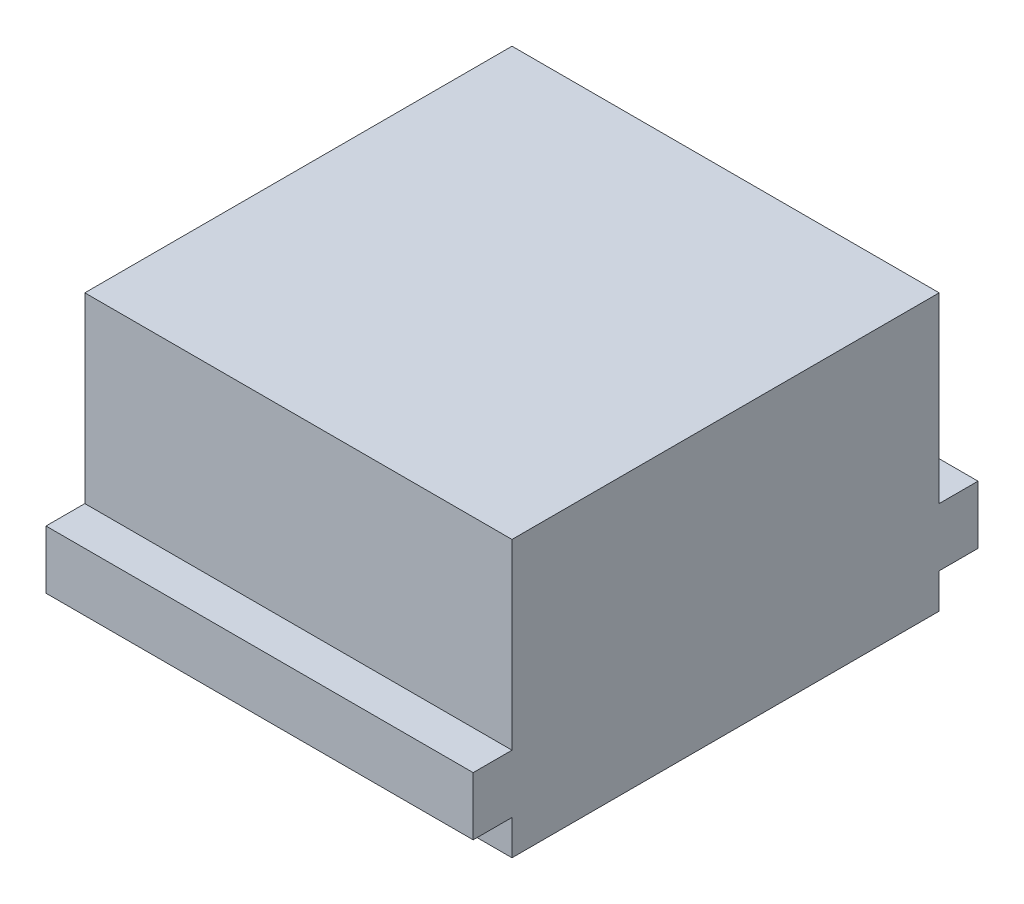
ISO-10303-21;
HEADER;
FILE_DESCRIPTION(('STEP AP214'),'2;1');
FILE_NAME('part.step','',(''),(''),'','','');
FILE_SCHEMA(('AUTOMOTIVE_DESIGN { 1 0 10303 214 1 1 1 1 }'));
ENDSEC;
DATA;
#1=APPLICATION_CONTEXT('core data for automotive mechanical design processes');
#2=APPLICATION_PROTOCOL_DEFINITION('international standard','automotive_design',2000,#1);
#3=PRODUCT_CONTEXT('',#1,'mechanical');
#4=PRODUCT('Part','Part','',(#3));
#5=PRODUCT_RELATED_PRODUCT_CATEGORY('part','',(#4));
#6=PRODUCT_DEFINITION_FORMATION('','',#4);
#7=PRODUCT_DEFINITION_CONTEXT('part definition',#1,'design');
#8=PRODUCT_DEFINITION('design','',#6,#7);
#9=PRODUCT_DEFINITION_SHAPE('','',#8);
#10=(LENGTH_UNIT() NAMED_UNIT(*) SI_UNIT(.MILLI.,.METRE.));
#11=(NAMED_UNIT(*) PLANE_ANGLE_UNIT() SI_UNIT($,.RADIAN.));
#12=(NAMED_UNIT(*) SI_UNIT($,.STERADIAN.) SOLID_ANGLE_UNIT());
#13=UNCERTAINTY_MEASURE_WITH_UNIT(LENGTH_MEASURE(1.E-05),#10,'distance_accuracy_value','');
#14=(GEOMETRIC_REPRESENTATION_CONTEXT(3) GLOBAL_UNCERTAINTY_ASSIGNED_CONTEXT((#13)) GLOBAL_UNIT_ASSIGNED_CONTEXT((#10,
#11,#12)) REPRESENTATION_CONTEXT('',''));
#15=CARTESIAN_POINT('',(0.,0.,0.));
#16=DIRECTION('',(0.,0.,1.));
#17=DIRECTION('',(1.,0.,0.));
#18=AXIS2_PLACEMENT_3D('',#15,#16,#17);
#19=CARTESIAN_POINT('',(0.,71.,-110.));
#20=DIRECTION('',(0.,0.,1.));
#21=DIRECTION('',(1.,0.,0.));
#22=AXIS2_PLACEMENT_3D('',#19,#20,#21);
#23=PLANE('',#22);
#24=DIRECTION('',(-1.,0.,0.));
#25=VECTOR('',#24,1.);
#26=CARTESIAN_POINT('',(0.,9.,-110.));
#27=LINE('',#26,#25);
#28=CARTESIAN_POINT('',(110.,9.,-110.));
#29=VERTEX_POINT('',#28);
#30=CARTESIAN_POINT('',(0.,9.,-110.));
#31=VERTEX_POINT('',#30);
#32=EDGE_CURVE('E56',#29,#31,#27,.T.);
#33=ORIENTED_EDGE('',*,*,#32,.F.);
#34=DIRECTION('',(0.,-1.,0.));
#35=VECTOR('',#34,1.);
#36=CARTESIAN_POINT('',(110.,71.,-110.));
#37=LINE('',#36,#35);
#38=CARTESIAN_POINT('',(110.,0.,-110.));
#39=VERTEX_POINT('',#38);
#40=EDGE_CURVE('E152',#29,#39,#37,.T.);
#41=ORIENTED_EDGE('',*,*,#40,.T.);
#42=DIRECTION('',(-1.,0.,0.));
#43=VECTOR('',#42,1.);
#44=CARTESIAN_POINT('',(0.,0.,-110.));
#45=LINE('',#44,#43);
#46=CARTESIAN_POINT('',(0.,0.,-110.));
#47=VERTEX_POINT('',#46);
#48=EDGE_CURVE('E190',#39,#47,#45,.T.);
#49=ORIENTED_EDGE('',*,*,#48,.T.);
#50=DIRECTION('',(0.,-1.,0.));
#51=VECTOR('',#50,1.);
#52=CARTESIAN_POINT('',(0.,71.,-110.));
#53=LINE('',#52,#51);
#54=EDGE_CURVE('E196',#31,#47,#53,.T.);
#55=ORIENTED_EDGE('',*,*,#54,.F.);
#56=EDGE_LOOP('',(#33,#41,#49,#55));
#57=FACE_BOUND('',#56,.T.);
#58=ADVANCED_FACE('F41',(#57),#23,.F.);
#59=CARTESIAN_POINT('',(0.,71.,0.));
#60=DIRECTION('',(0.,0.,-1.));
#61=DIRECTION('',(-1.,0.,0.));
#62=AXIS2_PLACEMENT_3D('',#59,#60,#61);
#63=PLANE('',#62);
#64=DIRECTION('',(-1.,0.,0.));
#65=VECTOR('',#64,1.);
#66=CARTESIAN_POINT('',(0.,24.,0.));
#67=LINE('',#66,#65);
#68=CARTESIAN_POINT('',(110.,24.,0.));
#69=VERTEX_POINT('',#68);
#70=CARTESIAN_POINT('',(0.,24.,0.));
#71=VERTEX_POINT('',#70);
#72=EDGE_CURVE('E156',#69,#71,#67,.T.);
#73=ORIENTED_EDGE('',*,*,#72,.F.);
#74=DIRECTION('',(0.,-1.,0.));
#75=VECTOR('',#74,1.);
#76=CARTESIAN_POINT('',(110.,71.,0.));
#77=LINE('',#76,#75);
#78=CARTESIAN_POINT('',(110.,71.,0.));
#79=VERTEX_POINT('',#78);
#80=EDGE_CURVE('E210',#79,#69,#77,.T.);
#81=ORIENTED_EDGE('',*,*,#80,.F.);
#82=DIRECTION('',(1.,0.,0.));
#83=VECTOR('',#82,1.);
#84=CARTESIAN_POINT('',(0.,71.,0.));
#85=LINE('',#84,#83);
#86=CARTESIAN_POINT('',(0.,71.,0.));
#87=VERTEX_POINT('',#86);
#88=EDGE_CURVE('E189',#87,#79,#85,.T.);
#89=ORIENTED_EDGE('',*,*,#88,.F.);
#90=DIRECTION('',(0.,-1.,0.));
#91=VECTOR('',#90,1.);
#92=CARTESIAN_POINT('',(0.,71.,0.));
#93=LINE('',#92,#91);
#94=EDGE_CURVE('E11',#87,#71,#93,.T.);
#95=ORIENTED_EDGE('',*,*,#94,.T.);
#96=EDGE_LOOP('',(#73,#81,#89,#95));
#97=FACE_BOUND('',#96,.T.);
#98=ADVANCED_FACE('F245',(#97),#63,.F.);
#99=DIRECTION('',(1.,0.,0.));
#100=VECTOR('',#99,1.);
#101=CARTESIAN_POINT('',(0.,8.99999999999999,0.));
#102=LINE('',#101,#100);
#103=CARTESIAN_POINT('',(0.,8.99999999999999,0.));
#104=VERTEX_POINT('',#103);
#105=CARTESIAN_POINT('',(110.,8.99999999999999,0.));
#106=VERTEX_POINT('',#105);
#107=EDGE_CURVE('E153',#104,#106,#102,.T.);
#108=ORIENTED_EDGE('',*,*,#107,.F.);
#109=CARTESIAN_POINT('',(0.,0.,0.));
#110=VERTEX_POINT('',#109);
#111=EDGE_CURVE('E49',#104,#110,#93,.T.);
#112=ORIENTED_EDGE('',*,*,#111,.T.);
#113=DIRECTION('',(1.,0.,0.));
#114=VECTOR('',#113,1.);
#115=CARTESIAN_POINT('',(0.,0.,0.));
#116=LINE('',#115,#114);
#117=CARTESIAN_POINT('',(110.,0.,0.));
#118=VERTEX_POINT('',#117);
#119=EDGE_CURVE('E199',#110,#118,#116,.T.);
#120=ORIENTED_EDGE('',*,*,#119,.T.);
#121=EDGE_CURVE('E209',#106,#118,#77,.T.);
#122=ORIENTED_EDGE('',*,*,#121,.F.);
#123=EDGE_LOOP('',(#108,#112,#120,#122));
#124=FACE_BOUND('',#123,.T.);
#125=ADVANCED_FACE('F221',(#124),#63,.F.);
#126=CARTESIAN_POINT('',(0.,71.,0.));
#127=DIRECTION('',(1.,0.,0.));
#128=DIRECTION('',(0.,0.,-1.));
#129=AXIS2_PLACEMENT_3D('',#126,#127,#128);
#130=PLANE('',#129);
#131=DIRECTION('',(0.,0.,1.));
#132=VECTOR('',#131,1.);
#133=CARTESIAN_POINT('',(0.,0.,0.));
#134=LINE('',#133,#132);
#135=EDGE_CURVE('E185',#47,#110,#134,.T.);
#136=ORIENTED_EDGE('',*,*,#135,.T.);
#137=ORIENTED_EDGE('',*,*,#111,.F.);
#138=DIRECTION('',(0.,0.,-1.));
#139=VECTOR('',#138,1.);
#140=CARTESIAN_POINT('',(0.,8.99999999999999,10.));
#141=LINE('',#140,#139);
#142=CARTESIAN_POINT('',(0.,8.99999999999999,10.));
#143=VERTEX_POINT('',#142);
#144=EDGE_CURVE('E182',#143,#104,#141,.T.);
#145=ORIENTED_EDGE('',*,*,#144,.F.);
#146=DIRECTION('',(0.,-1.,0.));
#147=VECTOR('',#146,1.);
#148=CARTESIAN_POINT('',(0.,0.,10.));
#149=LINE('',#148,#147);
#150=CARTESIAN_POINT('',(0.,24.,10.));
#151=VERTEX_POINT('',#150);
#152=EDGE_CURVE('E162',#151,#143,#149,.T.);
#153=ORIENTED_EDGE('',*,*,#152,.F.);
#154=DIRECTION('',(0.,0.,-1.));
#155=VECTOR('',#154,1.);
#156=CARTESIAN_POINT('',(0.,24.,10.));
#157=LINE('',#156,#155);
#158=EDGE_CURVE('E170',#151,#71,#157,.T.);
#159=ORIENTED_EDGE('',*,*,#158,.T.);
#160=ORIENTED_EDGE('',*,*,#94,.F.);
#161=DIRECTION('',(0.,0.,1.));
#162=VECTOR('',#161,1.);
#163=CARTESIAN_POINT('',(0.,71.,0.));
#164=LINE('',#163,#162);
#165=CARTESIAN_POINT('',(0.,71.,-110.));
#166=VERTEX_POINT('',#165);
#167=EDGE_CURVE('E186',#166,#87,#164,.T.);
#168=ORIENTED_EDGE('',*,*,#167,.F.);
#169=CARTESIAN_POINT('',(0.,24.,-110.));
#170=VERTEX_POINT('',#169);
#171=EDGE_CURVE('E206',#166,#170,#53,.T.);
#172=ORIENTED_EDGE('',*,*,#171,.T.);
#173=DIRECTION('',(0.,0.,1.));
#174=VECTOR('',#173,1.);
#175=CARTESIAN_POINT('',(0.,24.,-120.));
#176=LINE('',#175,#174);
#177=CARTESIAN_POINT('',(0.,24.,-120.));
#178=VERTEX_POINT('',#177);
#179=EDGE_CURVE('E158',#178,#170,#176,.T.);
#180=ORIENTED_EDGE('',*,*,#179,.F.);
#181=DIRECTION('',(0.,1.,0.));
#182=VECTOR('',#181,1.);
#183=CARTESIAN_POINT('',(0.,0.,-120.));
#184=LINE('',#183,#182);
#185=CARTESIAN_POINT('',(0.,9.,-120.));
#186=VERTEX_POINT('',#185);
#187=EDGE_CURVE('E139',#186,#178,#184,.T.);
#188=ORIENTED_EDGE('',*,*,#187,.F.);
#189=DIRECTION('',(0.,0.,1.));
#190=VECTOR('',#189,1.);
#191=CARTESIAN_POINT('',(0.,9.,-120.));
#192=LINE('',#191,#190);
#193=EDGE_CURVE('E136',#186,#31,#192,.T.);
#194=ORIENTED_EDGE('',*,*,#193,.T.);
#195=ORIENTED_EDGE('',*,*,#54,.T.);
#196=EDGE_LOOP('',(#136,#137,#145,#153,#159,#160,#168,#172,#180,#188,#194,#195));
#197=FACE_BOUND('',#196,.T.);
#198=ADVANCED_FACE('F43',(#197),#130,.F.);
#199=CARTESIAN_POINT('',(110.,71.,0.));
#200=DIRECTION('',(-1.,0.,0.));
#201=DIRECTION('',(0.,0.,1.));
#202=AXIS2_PLACEMENT_3D('',#199,#200,#201);
#203=PLANE('',#202);
#204=DIRECTION('',(0.,0.,-1.));
#205=VECTOR('',#204,1.);
#206=CARTESIAN_POINT('',(110.,0.,0.));
#207=LINE('',#206,#205);
#208=EDGE_CURVE('E202',#118,#39,#207,.T.);
#209=ORIENTED_EDGE('',*,*,#208,.T.);
#210=ORIENTED_EDGE('',*,*,#40,.F.);
#211=DIRECTION('',(0.,0.,1.));
#212=VECTOR('',#211,1.);
#213=CARTESIAN_POINT('',(110.,9.,-120.));
#214=LINE('',#213,#212);
#215=CARTESIAN_POINT('',(110.,9.,-120.));
#216=VERTEX_POINT('',#215);
#217=EDGE_CURVE('E134',#216,#29,#214,.T.);
#218=ORIENTED_EDGE('',*,*,#217,.F.);
#219=DIRECTION('',(0.,-1.,0.));
#220=VECTOR('',#219,1.);
#221=CARTESIAN_POINT('',(110.,0.,-120.));
#222=LINE('',#221,#220);
#223=CARTESIAN_POINT('',(110.,24.,-120.));
#224=VERTEX_POINT('',#223);
#225=EDGE_CURVE('E140',#224,#216,#222,.T.);
#226=ORIENTED_EDGE('',*,*,#225,.F.);
#227=DIRECTION('',(0.,0.,1.));
#228=VECTOR('',#227,1.);
#229=CARTESIAN_POINT('',(110.,24.,-120.));
#230=LINE('',#229,#228);
#231=CARTESIAN_POINT('',(110.,24.,-110.));
#232=VERTEX_POINT('',#231);
#233=EDGE_CURVE('E231',#224,#232,#230,.T.);
#234=ORIENTED_EDGE('',*,*,#233,.T.);
#235=CARTESIAN_POINT('',(110.,71.,-110.));
#236=VERTEX_POINT('',#235);
#237=EDGE_CURVE('E64',#236,#232,#37,.T.);
#238=ORIENTED_EDGE('',*,*,#237,.F.);
#239=DIRECTION('',(0.,0.,-1.));
#240=VECTOR('',#239,1.);
#241=CARTESIAN_POINT('',(110.,71.,0.));
#242=LINE('',#241,#240);
#243=EDGE_CURVE('E192',#79,#236,#242,.T.);
#244=ORIENTED_EDGE('',*,*,#243,.F.);
#245=ORIENTED_EDGE('',*,*,#80,.T.);
#246=DIRECTION('',(0.,0.,-1.));
#247=VECTOR('',#246,1.);
#248=CARTESIAN_POINT('',(110.,24.,10.));
#249=LINE('',#248,#247);
#250=CARTESIAN_POINT('',(110.,24.,10.));
#251=VERTEX_POINT('',#250);
#252=EDGE_CURVE('E176',#251,#69,#249,.T.);
#253=ORIENTED_EDGE('',*,*,#252,.F.);
#254=DIRECTION('',(0.,1.,0.));
#255=VECTOR('',#254,1.);
#256=CARTESIAN_POINT('',(110.,0.,10.));
#257=LINE('',#256,#255);
#258=CARTESIAN_POINT('',(110.,8.99999999999999,10.));
#259=VERTEX_POINT('',#258);
#260=EDGE_CURVE('E167',#259,#251,#257,.T.);
#261=ORIENTED_EDGE('',*,*,#260,.F.);
#262=DIRECTION('',(0.,0.,-1.));
#263=VECTOR('',#262,1.);
#264=CARTESIAN_POINT('',(110.,8.99999999999999,10.));
#265=LINE('',#264,#263);
#266=EDGE_CURVE('E179',#259,#106,#265,.T.);
#267=ORIENTED_EDGE('',*,*,#266,.T.);
#268=ORIENTED_EDGE('',*,*,#121,.T.);
#269=EDGE_LOOP('',(#209,#210,#218,#226,#234,#238,#244,#245,#253,#261,#267,#268));
#270=FACE_BOUND('',#269,.T.);
#271=ADVANCED_FACE('F151',(#270),#203,.F.);
#272=ORIENTED_EDGE('',*,*,#237,.T.);
#273=DIRECTION('',(-1.,0.,0.));
#274=VECTOR('',#273,1.);
#275=CARTESIAN_POINT('',(0.,24.,-110.));
#276=LINE('',#275,#274);
#277=EDGE_CURVE('E148',#232,#170,#276,.T.);
#278=ORIENTED_EDGE('',*,*,#277,.T.);
#279=ORIENTED_EDGE('',*,*,#171,.F.);
#280=DIRECTION('',(-1.,0.,0.));
#281=VECTOR('',#280,1.);
#282=CARTESIAN_POINT('',(0.,71.,-110.));
#283=LINE('',#282,#281);
#284=EDGE_CURVE('E194',#236,#166,#283,.T.);
#285=ORIENTED_EDGE('',*,*,#284,.F.);
#286=EDGE_LOOP('',(#272,#278,#279,#285));
#287=FACE_BOUND('',#286,.T.);
#288=ADVANCED_FACE('F239',(#287),#23,.F.);
#289=CARTESIAN_POINT('',(0.,71.,0.));
#290=DIRECTION('',(0.,-1.,0.));
#291=DIRECTION('',(0.,0.,-1.));
#292=AXIS2_PLACEMENT_3D('',#289,#290,#291);
#293=PLANE('',#292);
#294=ORIENTED_EDGE('',*,*,#167,.T.);
#295=ORIENTED_EDGE('',*,*,#88,.T.);
#296=ORIENTED_EDGE('',*,*,#243,.T.);
#297=ORIENTED_EDGE('',*,*,#284,.T.);
#298=EDGE_LOOP('',(#294,#295,#296,#297));
#299=FACE_BOUND('',#298,.T.);
#300=ADVANCED_FACE('F242',(#299),#293,.F.);
#301=CARTESIAN_POINT('',(0.,0.,0.));
#302=DIRECTION('',(0.,-1.,0.));
#303=DIRECTION('',(0.,0.,-1.));
#304=AXIS2_PLACEMENT_3D('',#301,#302,#303);
#305=PLANE('',#304);
#306=ORIENTED_EDGE('',*,*,#135,.F.);
#307=ORIENTED_EDGE('',*,*,#48,.F.);
#308=ORIENTED_EDGE('',*,*,#208,.F.);
#309=ORIENTED_EDGE('',*,*,#119,.F.);
#310=EDGE_LOOP('',(#306,#307,#308,#309));
#311=FACE_BOUND('',#310,.T.);
#312=ADVANCED_FACE('F225',(#311),#305,.T.);
#313=CARTESIAN_POINT('',(0.,8.99999999999999,10.));
#314=DIRECTION('',(0.,1.,0.));
#315=DIRECTION('',(0.,0.,1.));
#316=AXIS2_PLACEMENT_3D('',#313,#314,#315);
#317=PLANE('',#316);
#318=ORIENTED_EDGE('',*,*,#107,.T.);
#319=ORIENTED_EDGE('',*,*,#266,.F.);
#320=DIRECTION('',(1.,0.,0.));
#321=VECTOR('',#320,1.);
#322=CARTESIAN_POINT('',(0.,8.99999999999999,10.));
#323=LINE('',#322,#321);
#324=EDGE_CURVE('E165',#143,#259,#323,.T.);
#325=ORIENTED_EDGE('',*,*,#324,.F.);
#326=ORIENTED_EDGE('',*,*,#144,.T.);
#327=EDGE_LOOP('',(#318,#319,#325,#326));
#328=FACE_BOUND('',#327,.T.);
#329=ADVANCED_FACE('F255',(#328),#317,.F.);
#330=CARTESIAN_POINT('',(0.,24.,10.));
#331=DIRECTION('',(0.,-1.,0.));
#332=DIRECTION('',(1.,0.,0.));
#333=AXIS2_PLACEMENT_3D('',#330,#331,#332);
#334=PLANE('',#333);
#335=ORIENTED_EDGE('',*,*,#72,.T.);
#336=ORIENTED_EDGE('',*,*,#158,.F.);
#337=DIRECTION('',(-1.,0.,0.));
#338=VECTOR('',#337,1.);
#339=CARTESIAN_POINT('',(0.,24.,10.));
#340=LINE('',#339,#338);
#341=EDGE_CURVE('E169',#251,#151,#340,.T.);
#342=ORIENTED_EDGE('',*,*,#341,.F.);
#343=ORIENTED_EDGE('',*,*,#252,.T.);
#344=EDGE_LOOP('',(#335,#336,#342,#343));
#345=FACE_BOUND('',#344,.T.);
#346=ADVANCED_FACE('F248',(#345),#334,.F.);
#347=CARTESIAN_POINT('',(0.,0.,10.));
#348=DIRECTION('',(0.,0.,1.));
#349=DIRECTION('',(1.,0.,0.));
#350=AXIS2_PLACEMENT_3D('',#347,#348,#349);
#351=PLANE('',#350);
#352=ORIENTED_EDGE('',*,*,#152,.T.);
#353=ORIENTED_EDGE('',*,*,#324,.T.);
#354=ORIENTED_EDGE('',*,*,#260,.T.);
#355=ORIENTED_EDGE('',*,*,#341,.T.);
#356=EDGE_LOOP('',(#352,#353,#354,#355));
#357=FACE_BOUND('',#356,.T.);
#358=ADVANCED_FACE('F253',(#357),#351,.T.);
#359=CARTESIAN_POINT('',(0.,9.,-120.));
#360=DIRECTION('',(0.,1.,0.));
#361=DIRECTION('',(0.,0.,1.));
#362=AXIS2_PLACEMENT_3D('',#359,#360,#361);
#363=PLANE('',#362);
#364=ORIENTED_EDGE('',*,*,#32,.T.);
#365=ORIENTED_EDGE('',*,*,#193,.F.);
#366=DIRECTION('',(-1.,0.,0.));
#367=VECTOR('',#366,1.);
#368=CARTESIAN_POINT('',(0.,9.,-120.));
#369=LINE('',#368,#367);
#370=EDGE_CURVE('E130',#216,#186,#369,.T.);
#371=ORIENTED_EDGE('',*,*,#370,.F.);
#372=ORIENTED_EDGE('',*,*,#217,.T.);
#373=EDGE_LOOP('',(#364,#365,#371,#372));
#374=FACE_BOUND('',#373,.T.);
#375=ADVANCED_FACE('F132',(#374),#363,.F.);
#376=CARTESIAN_POINT('',(0.,24.,-120.));
#377=DIRECTION('',(0.,1.,0.));
#378=DIRECTION('',(0.,0.,1.));
#379=AXIS2_PLACEMENT_3D('',#376,#377,#378);
#380=PLANE('',#379);
#381=ORIENTED_EDGE('',*,*,#277,.F.);
#382=ORIENTED_EDGE('',*,*,#233,.F.);
#383=DIRECTION('',(-1.,0.,0.));
#384=VECTOR('',#383,1.);
#385=CARTESIAN_POINT('',(0.,24.,-120.));
#386=LINE('',#385,#384);
#387=EDGE_CURVE('E146',#224,#178,#386,.T.);
#388=ORIENTED_EDGE('',*,*,#387,.T.);
#389=ORIENTED_EDGE('',*,*,#179,.T.);
#390=EDGE_LOOP('',(#381,#382,#388,#389));
#391=FACE_BOUND('',#390,.T.);
#392=ADVANCED_FACE('F237',(#391),#380,.T.);
#393=CARTESIAN_POINT('',(0.,0.,-120.));
#394=DIRECTION('',(0.,0.,-1.));
#395=DIRECTION('',(-1.,0.,0.));
#396=AXIS2_PLACEMENT_3D('',#393,#394,#395);
#397=PLANE('',#396);
#398=ORIENTED_EDGE('',*,*,#225,.T.);
#399=ORIENTED_EDGE('',*,*,#370,.T.);
#400=ORIENTED_EDGE('',*,*,#187,.T.);
#401=ORIENTED_EDGE('',*,*,#387,.F.);
#402=EDGE_LOOP('',(#398,#399,#400,#401));
#403=FACE_BOUND('',#402,.T.);
#404=ADVANCED_FACE('F144',(#403),#397,.T.);
#405=CLOSED_SHELL('',(#58,#98,#125,#198,#271,#288,#300,#312,#329,#346,#358,#375,#392,#404));
#406=MANIFOLD_SOLID_BREP('B2',#405);
#407=ADVANCED_BREP_SHAPE_REPRESENTATION('',(#18,#406),#14);
#408=SHAPE_DEFINITION_REPRESENTATION(#9,#407);
ENDSEC;
END-ISO-10303-21;
